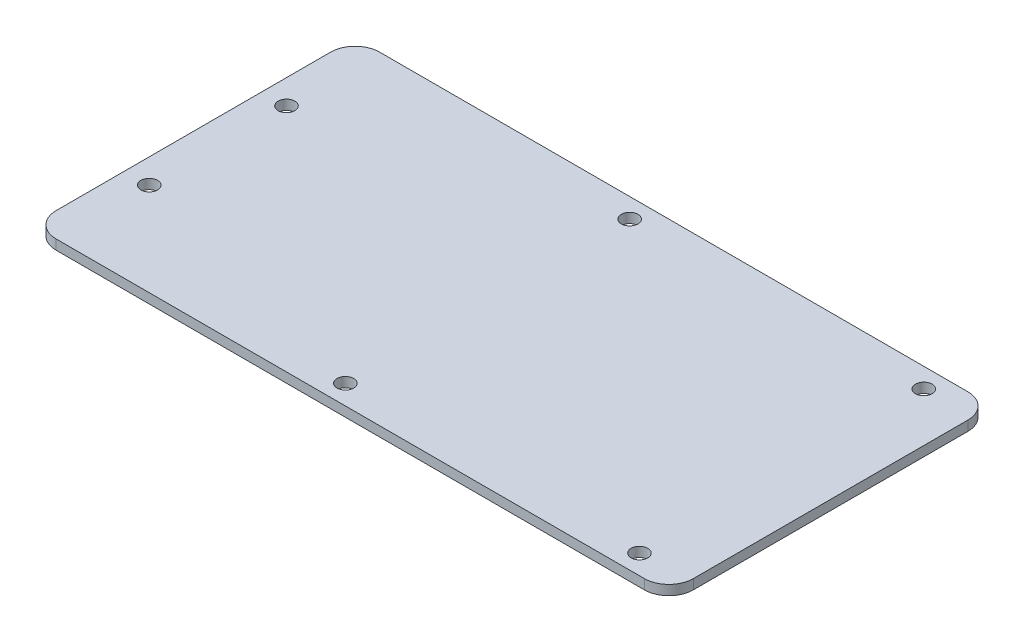
ISO-10303-21;
HEADER;
FILE_DESCRIPTION(('STEP AP214'),'2;1');
FILE_NAME('part.step','',(''),(''),'','','');
FILE_SCHEMA(('AUTOMOTIVE_DESIGN { 1 0 10303 214 1 1 1 1 }'));
ENDSEC;
DATA;
#1=APPLICATION_CONTEXT('core data for automotive mechanical design processes');
#2=APPLICATION_PROTOCOL_DEFINITION('international standard','automotive_design',2000,#1);
#3=PRODUCT_CONTEXT('',#1,'mechanical');
#4=PRODUCT('Part','Part','',(#3));
#5=PRODUCT_RELATED_PRODUCT_CATEGORY('part','',(#4));
#6=PRODUCT_DEFINITION_FORMATION('','',#4);
#7=PRODUCT_DEFINITION_CONTEXT('part definition',#1,'design');
#8=PRODUCT_DEFINITION('design','',#6,#7);
#9=PRODUCT_DEFINITION_SHAPE('','',#8);
#10=(LENGTH_UNIT() NAMED_UNIT(*) SI_UNIT(.MILLI.,.METRE.));
#11=(NAMED_UNIT(*) PLANE_ANGLE_UNIT() SI_UNIT($,.RADIAN.));
#12=(NAMED_UNIT(*) SI_UNIT($,.STERADIAN.) SOLID_ANGLE_UNIT());
#13=UNCERTAINTY_MEASURE_WITH_UNIT(LENGTH_MEASURE(1.E-05),#10,'distance_accuracy_value','');
#14=(GEOMETRIC_REPRESENTATION_CONTEXT(3) GLOBAL_UNCERTAINTY_ASSIGNED_CONTEXT((#13)) GLOBAL_UNIT_ASSIGNED_CONTEXT((#10,
#11,#12)) REPRESENTATION_CONTEXT('',''));
#15=CARTESIAN_POINT('',(0.,0.,0.));
#16=DIRECTION('',(0.,0.,1.));
#17=DIRECTION('',(1.,0.,0.));
#18=AXIS2_PLACEMENT_3D('',#15,#16,#17);
#19=CARTESIAN_POINT('',(0.,2.,0.));
#20=DIRECTION('',(1.,0.,0.));
#21=DIRECTION('',(0.,0.,-1.));
#22=AXIS2_PLACEMENT_3D('',#19,#20,#21);
#23=PLANE('',#22);
#24=DIRECTION('',(0.,0.,1.));
#25=VECTOR('',#24,1.);
#26=CARTESIAN_POINT('',(0.,0.,0.));
#27=LINE('',#26,#25);
#28=CARTESIAN_POINT('',(0.,0.,-61.));
#29=VERTEX_POINT('',#28);
#30=CARTESIAN_POINT('',(0.,0.,-5.));
#31=VERTEX_POINT('',#30);
#32=EDGE_CURVE('E156',#29,#31,#27,.T.);
#33=ORIENTED_EDGE('',*,*,#32,.T.);
#34=DIRECTION('',(0.,-1.,0.));
#35=VECTOR('',#34,1.);
#36=CARTESIAN_POINT('',(0.,2.,-5.));
#37=LINE('',#36,#35);
#38=CARTESIAN_POINT('',(0.,2.,-5.));
#39=VERTEX_POINT('',#38);
#40=EDGE_CURVE('E11',#31,#39,#37,.F.);
#41=ORIENTED_EDGE('',*,*,#40,.T.);
#42=DIRECTION('',(0.,0.,1.));
#43=VECTOR('',#42,1.);
#44=CARTESIAN_POINT('',(0.,2.,0.));
#45=LINE('',#44,#43);
#46=CARTESIAN_POINT('',(0.,2.,-61.));
#47=VERTEX_POINT('',#46);
#48=EDGE_CURVE('E124',#47,#39,#45,.T.);
#49=ORIENTED_EDGE('',*,*,#48,.F.);
#50=DIRECTION('',(0.,-1.,0.));
#51=VECTOR('',#50,1.);
#52=CARTESIAN_POINT('',(0.,2.,-61.));
#53=LINE('',#52,#51);
#54=EDGE_CURVE('E40',#47,#29,#53,.T.);
#55=ORIENTED_EDGE('',*,*,#54,.T.);
#56=EDGE_LOOP('',(#33,#41,#49,#55));
#57=FACE_BOUND('',#56,.T.);
#58=ADVANCED_FACE('F32',(#57),#23,.F.);
#59=CARTESIAN_POINT('',(0.,2.,0.));
#60=DIRECTION('',(0.,0.,-1.));
#61=DIRECTION('',(-1.,0.,0.));
#62=AXIS2_PLACEMENT_3D('',#59,#60,#61);
#63=PLANE('',#62);
#64=DIRECTION('',(1.,0.,0.));
#65=VECTOR('',#64,1.);
#66=CARTESIAN_POINT('',(0.,0.,0.));
#67=LINE('',#66,#65);
#68=CARTESIAN_POINT('',(5.,0.,0.));
#69=VERTEX_POINT('',#68);
#70=CARTESIAN_POINT('',(125.,0.,0.));
#71=VERTEX_POINT('',#70);
#72=EDGE_CURVE('E129',#69,#71,#67,.T.);
#73=ORIENTED_EDGE('',*,*,#72,.T.);
#74=DIRECTION('',(0.,-1.,0.));
#75=VECTOR('',#74,1.);
#76=CARTESIAN_POINT('',(125.,2.,0.));
#77=LINE('',#76,#75);
#78=CARTESIAN_POINT('',(125.,2.,0.));
#79=VERTEX_POINT('',#78);
#80=EDGE_CURVE('E47',#71,#79,#77,.F.);
#81=ORIENTED_EDGE('',*,*,#80,.T.);
#82=DIRECTION('',(1.,0.,0.));
#83=VECTOR('',#82,1.);
#84=CARTESIAN_POINT('',(0.,2.,0.));
#85=LINE('',#84,#83);
#86=CARTESIAN_POINT('',(5.,2.,0.));
#87=VERTEX_POINT('',#86);
#88=EDGE_CURVE('E127',#87,#79,#85,.T.);
#89=ORIENTED_EDGE('',*,*,#88,.F.);
#90=DIRECTION('',(0.,-1.,0.));
#91=VECTOR('',#90,1.);
#92=CARTESIAN_POINT('',(5.,2.,0.));
#93=LINE('',#92,#91);
#94=EDGE_CURVE('E148',#87,#69,#93,.T.);
#95=ORIENTED_EDGE('',*,*,#94,.T.);
#96=EDGE_LOOP('',(#73,#81,#89,#95));
#97=FACE_BOUND('',#96,.T.);
#98=ADVANCED_FACE('F227',(#97),#63,.F.);
#99=CARTESIAN_POINT('',(130.,2.,0.));
#100=DIRECTION('',(-1.,0.,0.));
#101=DIRECTION('',(0.,0.,1.));
#102=AXIS2_PLACEMENT_3D('',#99,#100,#101);
#103=PLANE('',#102);
#104=DIRECTION('',(0.,0.,-1.));
#105=VECTOR('',#104,1.);
#106=CARTESIAN_POINT('',(130.,0.,0.));
#107=LINE('',#106,#105);
#108=CARTESIAN_POINT('',(130.,0.,-5.));
#109=VERTEX_POINT('',#108);
#110=CARTESIAN_POINT('',(130.,0.,-61.));
#111=VERTEX_POINT('',#110);
#112=EDGE_CURVE('E125',#109,#111,#107,.T.);
#113=ORIENTED_EDGE('',*,*,#112,.T.);
#114=DIRECTION('',(0.,-1.,0.));
#115=VECTOR('',#114,1.);
#116=CARTESIAN_POINT('',(130.,2.,-61.));
#117=LINE('',#116,#115);
#118=CARTESIAN_POINT('',(130.,2.,-61.));
#119=VERTEX_POINT('',#118);
#120=EDGE_CURVE('E103',#111,#119,#117,.F.);
#121=ORIENTED_EDGE('',*,*,#120,.T.);
#122=DIRECTION('',(0.,0.,-1.));
#123=VECTOR('',#122,1.);
#124=CARTESIAN_POINT('',(130.,2.,0.));
#125=LINE('',#124,#123);
#126=CARTESIAN_POINT('',(130.,2.,-5.));
#127=VERTEX_POINT('',#126);
#128=EDGE_CURVE('E168',#127,#119,#125,.T.);
#129=ORIENTED_EDGE('',*,*,#128,.F.);
#130=DIRECTION('',(0.,-1.,0.));
#131=VECTOR('',#130,1.);
#132=CARTESIAN_POINT('',(130.,2.,-5.));
#133=LINE('',#132,#131);
#134=EDGE_CURVE('E108',#127,#109,#133,.T.);
#135=ORIENTED_EDGE('',*,*,#134,.T.);
#136=EDGE_LOOP('',(#113,#121,#129,#135));
#137=FACE_BOUND('',#136,.T.);
#138=ADVANCED_FACE('F224',(#137),#103,.F.);
#139=CARTESIAN_POINT('',(0.,2.,-66.));
#140=DIRECTION('',(0.,0.,1.));
#141=DIRECTION('',(1.,0.,0.));
#142=AXIS2_PLACEMENT_3D('',#139,#140,#141);
#143=PLANE('',#142);
#144=DIRECTION('',(-1.,0.,0.));
#145=VECTOR('',#144,1.);
#146=CARTESIAN_POINT('',(0.,2.,-66.));
#147=LINE('',#146,#145);
#148=CARTESIAN_POINT('',(125.,2.,-66.));
#149=VERTEX_POINT('',#148);
#150=CARTESIAN_POINT('',(5.,2.,-66.));
#151=VERTEX_POINT('',#150);
#152=EDGE_CURVE('E118',#149,#151,#147,.T.);
#153=ORIENTED_EDGE('',*,*,#152,.F.);
#154=DIRECTION('',(0.,-1.,0.));
#155=VECTOR('',#154,1.);
#156=CARTESIAN_POINT('',(125.,2.,-66.));
#157=LINE('',#156,#155);
#158=CARTESIAN_POINT('',(125.,0.,-66.));
#159=VERTEX_POINT('',#158);
#160=EDGE_CURVE('E102',#149,#159,#157,.T.);
#161=ORIENTED_EDGE('',*,*,#160,.T.);
#162=DIRECTION('',(-1.,0.,0.));
#163=VECTOR('',#162,1.);
#164=CARTESIAN_POINT('',(0.,0.,-66.));
#165=LINE('',#164,#163);
#166=CARTESIAN_POINT('',(5.,0.,-66.));
#167=VERTEX_POINT('',#166);
#168=EDGE_CURVE('E115',#159,#167,#165,.T.);
#169=ORIENTED_EDGE('',*,*,#168,.T.);
#170=DIRECTION('',(0.,-1.,0.));
#171=VECTOR('',#170,1.);
#172=CARTESIAN_POINT('',(5.,2.,-66.));
#173=LINE('',#172,#171);
#174=EDGE_CURVE('E120',#167,#151,#173,.F.);
#175=ORIENTED_EDGE('',*,*,#174,.T.);
#176=EDGE_LOOP('',(#153,#161,#169,#175));
#177=FACE_BOUND('',#176,.T.);
#178=ADVANCED_FACE('F114',(#177),#143,.F.);
#179=CARTESIAN_POINT('',(0.,2.,0.));
#180=DIRECTION('',(0.,-1.,0.));
#181=DIRECTION('',(0.,0.,-1.));
#182=AXIS2_PLACEMENT_3D('',#179,#180,#181);
#183=PLANE('',#182);
#184=CARTESIAN_POINT('',(5.00000000000001,2.,-19.));
#185=DIRECTION('',(0.,1.,0.));
#186=DIRECTION('',(0.,0.,1.));
#187=AXIS2_PLACEMENT_3D('',#184,#185,#186);
#188=CIRCLE('',#187,1.7);
#189=CARTESIAN_POINT('',(5.00000000000001,2.,-17.3));
#190=VERTEX_POINT('',#189);
#191=EDGE_CURVE('E201',#190,#190,#188,.T.);
#192=ORIENTED_EDGE('',*,*,#191,.F.);
#193=EDGE_LOOP('',(#192));
#194=FACE_BOUND('',#193,.T.);
#195=CARTESIAN_POINT('',(60.,2.,-4.));
#196=DIRECTION('',(0.,1.,0.));
#197=DIRECTION('',(0.,0.,1.));
#198=AXIS2_PLACEMENT_3D('',#195,#196,#197);
#199=CIRCLE('',#198,1.7);
#200=CARTESIAN_POINT('',(60.,2.,-2.3));
#201=VERTEX_POINT('',#200);
#202=EDGE_CURVE('E195',#201,#201,#199,.T.);
#203=ORIENTED_EDGE('',*,*,#202,.F.);
#204=EDGE_LOOP('',(#203));
#205=FACE_BOUND('',#204,.T.);
#206=CARTESIAN_POINT('',(120.,2.,-4.));
#207=DIRECTION('',(0.,1.,0.));
#208=DIRECTION('',(0.,0.,1.));
#209=AXIS2_PLACEMENT_3D('',#206,#207,#208);
#210=CIRCLE('',#209,1.69999999999999);
#211=CARTESIAN_POINT('',(120.,2.,-2.30000000000001));
#212=VERTEX_POINT('',#211);
#213=EDGE_CURVE('E189',#212,#212,#210,.T.);
#214=ORIENTED_EDGE('',*,*,#213,.F.);
#215=EDGE_LOOP('',(#214));
#216=FACE_BOUND('',#215,.T.);
#217=CARTESIAN_POINT('',(120.,2.,-62.));
#218=DIRECTION('',(0.,1.,0.));
#219=DIRECTION('',(0.,0.,1.));
#220=AXIS2_PLACEMENT_3D('',#217,#218,#219);
#221=CIRCLE('',#220,1.69999999999999);
#222=CARTESIAN_POINT('',(120.,2.,-60.3));
#223=VERTEX_POINT('',#222);
#224=EDGE_CURVE('E183',#223,#223,#221,.T.);
#225=ORIENTED_EDGE('',*,*,#224,.F.);
#226=EDGE_LOOP('',(#225));
#227=FACE_BOUND('',#226,.T.);
#228=CARTESIAN_POINT('',(60.,2.,-62.));
#229=DIRECTION('',(0.,1.,0.));
#230=DIRECTION('',(0.,0.,1.));
#231=AXIS2_PLACEMENT_3D('',#228,#229,#230);
#232=CIRCLE('',#231,1.7);
#233=CARTESIAN_POINT('',(60.,2.,-60.3));
#234=VERTEX_POINT('',#233);
#235=EDGE_CURVE('E177',#234,#234,#232,.T.);
#236=ORIENTED_EDGE('',*,*,#235,.F.);
#237=EDGE_LOOP('',(#236));
#238=FACE_BOUND('',#237,.T.);
#239=CARTESIAN_POINT('',(5.00000000000001,2.,-47.));
#240=DIRECTION('',(0.,1.,0.));
#241=DIRECTION('',(0.,0.,1.));
#242=AXIS2_PLACEMENT_3D('',#239,#240,#241);
#243=CIRCLE('',#242,1.7);
#244=CARTESIAN_POINT('',(5.00000000000001,2.,-45.3));
#245=VERTEX_POINT('',#244);
#246=EDGE_CURVE('E164',#245,#245,#243,.T.);
#247=ORIENTED_EDGE('',*,*,#246,.F.);
#248=EDGE_LOOP('',(#247));
#249=FACE_BOUND('',#248,.T.);
#250=ORIENTED_EDGE('',*,*,#128,.T.);
#251=CARTESIAN_POINT('',(125.,2.,-61.));
#252=DIRECTION('',(0.,-1.,0.));
#253=DIRECTION('',(0.,0.,-1.));
#254=AXIS2_PLACEMENT_3D('',#251,#252,#253);
#255=CIRCLE('',#254,5.);
#256=EDGE_CURVE('E146',#119,#149,#255,.F.);
#257=ORIENTED_EDGE('',*,*,#256,.T.);
#258=ORIENTED_EDGE('',*,*,#152,.T.);
#259=CARTESIAN_POINT('',(5.,2.,-61.));
#260=DIRECTION('',(0.,-1.,0.));
#261=DIRECTION('',(0.,0.,-1.));
#262=AXIS2_PLACEMENT_3D('',#259,#260,#261);
#263=CIRCLE('',#262,5.);
#264=EDGE_CURVE('E141',#151,#47,#263,.F.);
#265=ORIENTED_EDGE('',*,*,#264,.T.);
#266=ORIENTED_EDGE('',*,*,#48,.T.);
#267=CARTESIAN_POINT('',(5.,2.,-5.));
#268=DIRECTION('',(0.,-1.,0.));
#269=DIRECTION('',(0.,0.,-1.));
#270=AXIS2_PLACEMENT_3D('',#267,#268,#269);
#271=CIRCLE('',#270,5.);
#272=EDGE_CURVE('E54',#39,#87,#271,.F.);
#273=ORIENTED_EDGE('',*,*,#272,.T.);
#274=ORIENTED_EDGE('',*,*,#88,.T.);
#275=CARTESIAN_POINT('',(125.,2.,-5.));
#276=DIRECTION('',(0.,-1.,0.));
#277=DIRECTION('',(0.,0.,-1.));
#278=AXIS2_PLACEMENT_3D('',#275,#276,#277);
#279=CIRCLE('',#278,5.);
#280=EDGE_CURVE('E144',#79,#127,#279,.F.);
#281=ORIENTED_EDGE('',*,*,#280,.T.);
#282=EDGE_LOOP('',(#250,#257,#258,#265,#266,#273,#274,#281));
#283=FACE_BOUND('',#282,.T.);
#284=ADVANCED_FACE('F207',(#194,#205,#216,#227,#238,#249,#283),#183,.F.);
#285=CARTESIAN_POINT('',(0.,0.,0.));
#286=DIRECTION('',(0.,-1.,0.));
#287=DIRECTION('',(0.,0.,-1.));
#288=AXIS2_PLACEMENT_3D('',#285,#286,#287);
#289=PLANE('',#288);
#290=CARTESIAN_POINT('',(5.00000000000001,0.,-19.));
#291=DIRECTION('',(0.,1.,0.));
#292=DIRECTION('',(0.,0.,1.));
#293=AXIS2_PLACEMENT_3D('',#290,#291,#292);
#294=CIRCLE('',#293,1.7);
#295=CARTESIAN_POINT('',(5.00000000000001,0.,-17.3));
#296=VERTEX_POINT('',#295);
#297=EDGE_CURVE('E198',#296,#296,#294,.T.);
#298=ORIENTED_EDGE('',*,*,#297,.T.);
#299=EDGE_LOOP('',(#298));
#300=FACE_BOUND('',#299,.T.);
#301=CARTESIAN_POINT('',(60.,0.,-4.));
#302=DIRECTION('',(0.,1.,0.));
#303=DIRECTION('',(0.,0.,1.));
#304=AXIS2_PLACEMENT_3D('',#301,#302,#303);
#305=CIRCLE('',#304,1.7);
#306=CARTESIAN_POINT('',(60.,0.,-2.3));
#307=VERTEX_POINT('',#306);
#308=EDGE_CURVE('E192',#307,#307,#305,.T.);
#309=ORIENTED_EDGE('',*,*,#308,.T.);
#310=EDGE_LOOP('',(#309));
#311=FACE_BOUND('',#310,.T.);
#312=CARTESIAN_POINT('',(120.,0.,-4.));
#313=DIRECTION('',(0.,1.,0.));
#314=DIRECTION('',(0.,0.,1.));
#315=AXIS2_PLACEMENT_3D('',#312,#313,#314);
#316=CIRCLE('',#315,1.69999999999999);
#317=CARTESIAN_POINT('',(120.,0.,-2.30000000000001));
#318=VERTEX_POINT('',#317);
#319=EDGE_CURVE('E186',#318,#318,#316,.T.);
#320=ORIENTED_EDGE('',*,*,#319,.T.);
#321=EDGE_LOOP('',(#320));
#322=FACE_BOUND('',#321,.T.);
#323=CARTESIAN_POINT('',(120.,0.,-62.));
#324=DIRECTION('',(0.,1.,0.));
#325=DIRECTION('',(0.,0.,1.));
#326=AXIS2_PLACEMENT_3D('',#323,#324,#325);
#327=CIRCLE('',#326,1.69999999999999);
#328=CARTESIAN_POINT('',(120.,0.,-60.3));
#329=VERTEX_POINT('',#328);
#330=EDGE_CURVE('E180',#329,#329,#327,.T.);
#331=ORIENTED_EDGE('',*,*,#330,.T.);
#332=EDGE_LOOP('',(#331));
#333=FACE_BOUND('',#332,.T.);
#334=CARTESIAN_POINT('',(60.,0.,-62.));
#335=DIRECTION('',(0.,1.,0.));
#336=DIRECTION('',(0.,0.,1.));
#337=AXIS2_PLACEMENT_3D('',#334,#335,#336);
#338=CIRCLE('',#337,1.7);
#339=CARTESIAN_POINT('',(60.,0.,-60.3));
#340=VERTEX_POINT('',#339);
#341=EDGE_CURVE('E174',#340,#340,#338,.T.);
#342=ORIENTED_EDGE('',*,*,#341,.T.);
#343=EDGE_LOOP('',(#342));
#344=FACE_BOUND('',#343,.T.);
#345=CARTESIAN_POINT('',(5.00000000000001,0.,-47.));
#346=DIRECTION('',(0.,1.,0.));
#347=DIRECTION('',(0.,0.,1.));
#348=AXIS2_PLACEMENT_3D('',#345,#346,#347);
#349=CIRCLE('',#348,1.7);
#350=CARTESIAN_POINT('',(5.00000000000001,0.,-45.3));
#351=VERTEX_POINT('',#350);
#352=EDGE_CURVE('E161',#351,#351,#349,.T.);
#353=ORIENTED_EDGE('',*,*,#352,.T.);
#354=EDGE_LOOP('',(#353));
#355=FACE_BOUND('',#354,.T.);
#356=ORIENTED_EDGE('',*,*,#168,.F.);
#357=CARTESIAN_POINT('',(125.,0.,-61.));
#358=DIRECTION('',(0.,-1.,0.));
#359=DIRECTION('',(0.,0.,-1.));
#360=AXIS2_PLACEMENT_3D('',#357,#358,#359);
#361=CIRCLE('',#360,5.);
#362=EDGE_CURVE('E98',#159,#111,#361,.T.);
#363=ORIENTED_EDGE('',*,*,#362,.T.);
#364=ORIENTED_EDGE('',*,*,#112,.F.);
#365=CARTESIAN_POINT('',(125.,0.,-5.));
#366=DIRECTION('',(0.,-1.,0.));
#367=DIRECTION('',(0.,0.,-1.));
#368=AXIS2_PLACEMENT_3D('',#365,#366,#367);
#369=CIRCLE('',#368,5.);
#370=EDGE_CURVE('E109',#109,#71,#369,.T.);
#371=ORIENTED_EDGE('',*,*,#370,.T.);
#372=ORIENTED_EDGE('',*,*,#72,.F.);
#373=CARTESIAN_POINT('',(5.,0.,-5.));
#374=DIRECTION('',(0.,-1.,0.));
#375=DIRECTION('',(0.,0.,-1.));
#376=AXIS2_PLACEMENT_3D('',#373,#374,#375);
#377=CIRCLE('',#376,5.);
#378=EDGE_CURVE('E135',#69,#31,#377,.T.);
#379=ORIENTED_EDGE('',*,*,#378,.T.);
#380=ORIENTED_EDGE('',*,*,#32,.F.);
#381=CARTESIAN_POINT('',(5.,0.,-61.));
#382=DIRECTION('',(0.,-1.,0.));
#383=DIRECTION('',(0.,0.,-1.));
#384=AXIS2_PLACEMENT_3D('',#381,#382,#383);
#385=CIRCLE('',#384,5.);
#386=EDGE_CURVE('E119',#29,#167,#385,.T.);
#387=ORIENTED_EDGE('',*,*,#386,.T.);
#388=EDGE_LOOP('',(#356,#363,#364,#371,#372,#379,#380,#387));
#389=FACE_BOUND('',#388,.T.);
#390=ADVANCED_FACE('F122',(#300,#311,#322,#333,#344,#355,#389),#289,.T.);
#391=CARTESIAN_POINT('',(125.,2.,-61.));
#392=DIRECTION('',(0.,-1.,0.));
#393=DIRECTION('',(0.,0.,-1.));
#394=AXIS2_PLACEMENT_3D('',#391,#392,#393);
#395=CYLINDRICAL_SURFACE('',#394,5.);
#396=ORIENTED_EDGE('',*,*,#256,.F.);
#397=ORIENTED_EDGE('',*,*,#120,.F.);
#398=ORIENTED_EDGE('',*,*,#362,.F.);
#399=ORIENTED_EDGE('',*,*,#160,.F.);
#400=EDGE_LOOP('',(#396,#397,#398,#399));
#401=FACE_BOUND('',#400,.T.);
#402=ADVANCED_FACE('F101',(#401),#395,.T.);
#403=CARTESIAN_POINT('',(125.,2.,-5.));
#404=DIRECTION('',(0.,-1.,0.));
#405=DIRECTION('',(0.,0.,-1.));
#406=AXIS2_PLACEMENT_3D('',#403,#404,#405);
#407=CYLINDRICAL_SURFACE('',#406,5.);
#408=ORIENTED_EDGE('',*,*,#280,.F.);
#409=ORIENTED_EDGE('',*,*,#80,.F.);
#410=ORIENTED_EDGE('',*,*,#370,.F.);
#411=ORIENTED_EDGE('',*,*,#134,.F.);
#412=EDGE_LOOP('',(#408,#409,#410,#411));
#413=FACE_BOUND('',#412,.T.);
#414=ADVANCED_FACE('F226',(#413),#407,.T.);
#415=CARTESIAN_POINT('',(5.,2.,-5.));
#416=DIRECTION('',(0.,-1.,0.));
#417=DIRECTION('',(0.,0.,-1.));
#418=AXIS2_PLACEMENT_3D('',#415,#416,#417);
#419=CYLINDRICAL_SURFACE('',#418,5.);
#420=ORIENTED_EDGE('',*,*,#272,.F.);
#421=ORIENTED_EDGE('',*,*,#40,.F.);
#422=ORIENTED_EDGE('',*,*,#378,.F.);
#423=ORIENTED_EDGE('',*,*,#94,.F.);
#424=EDGE_LOOP('',(#420,#421,#422,#423));
#425=FACE_BOUND('',#424,.T.);
#426=ADVANCED_FACE('F230',(#425),#419,.T.);
#427=CARTESIAN_POINT('',(5.,2.,-61.));
#428=DIRECTION('',(0.,-1.,0.));
#429=DIRECTION('',(0.,0.,-1.));
#430=AXIS2_PLACEMENT_3D('',#427,#428,#429);
#431=CYLINDRICAL_SURFACE('',#430,5.);
#432=ORIENTED_EDGE('',*,*,#264,.F.);
#433=ORIENTED_EDGE('',*,*,#174,.F.);
#434=ORIENTED_EDGE('',*,*,#386,.F.);
#435=ORIENTED_EDGE('',*,*,#54,.F.);
#436=EDGE_LOOP('',(#432,#433,#434,#435));
#437=FACE_BOUND('',#436,.T.);
#438=ADVANCED_FACE('F34',(#437),#431,.T.);
#439=CARTESIAN_POINT('',(5.00000000000001,2.,-47.));
#440=DIRECTION('',(0.,1.,0.));
#441=DIRECTION('',(0.,0.,1.));
#442=AXIS2_PLACEMENT_3D('',#439,#440,#441);
#443=CYLINDRICAL_SURFACE('',#442,1.7);
#444=ORIENTED_EDGE('',*,*,#352,.F.);
#445=EDGE_LOOP('',(#444));
#446=FACE_BOUND('',#445,.T.);
#447=ORIENTED_EDGE('',*,*,#246,.T.);
#448=EDGE_LOOP('',(#447));
#449=FACE_BOUND('',#448,.T.);
#450=ADVANCED_FACE('F232',(#446,#449),#443,.F.);
#451=CARTESIAN_POINT('',(60.,2.,-62.));
#452=DIRECTION('',(0.,1.,0.));
#453=DIRECTION('',(0.,0.,1.));
#454=AXIS2_PLACEMENT_3D('',#451,#452,#453);
#455=CYLINDRICAL_SURFACE('',#454,1.7);
#456=ORIENTED_EDGE('',*,*,#341,.F.);
#457=EDGE_LOOP('',(#456));
#458=FACE_BOUND('',#457,.T.);
#459=ORIENTED_EDGE('',*,*,#235,.T.);
#460=EDGE_LOOP('',(#459));
#461=FACE_BOUND('',#460,.T.);
#462=ADVANCED_FACE('F237',(#458,#461),#455,.F.);
#463=CARTESIAN_POINT('',(120.,2.,-62.));
#464=DIRECTION('',(0.,1.,0.));
#465=DIRECTION('',(0.,0.,1.));
#466=AXIS2_PLACEMENT_3D('',#463,#464,#465);
#467=CYLINDRICAL_SURFACE('',#466,1.69999999999999);
#468=ORIENTED_EDGE('',*,*,#330,.F.);
#469=EDGE_LOOP('',(#468));
#470=FACE_BOUND('',#469,.T.);
#471=ORIENTED_EDGE('',*,*,#224,.T.);
#472=EDGE_LOOP('',(#471));
#473=FACE_BOUND('',#472,.T.);
#474=ADVANCED_FACE('F296',(#470,#473),#467,.F.);
#475=CARTESIAN_POINT('',(120.,2.,-4.));
#476=DIRECTION('',(0.,1.,0.));
#477=DIRECTION('',(0.,0.,1.));
#478=AXIS2_PLACEMENT_3D('',#475,#476,#477);
#479=CYLINDRICAL_SURFACE('',#478,1.69999999999999);
#480=ORIENTED_EDGE('',*,*,#319,.F.);
#481=EDGE_LOOP('',(#480));
#482=FACE_BOUND('',#481,.T.);
#483=ORIENTED_EDGE('',*,*,#213,.T.);
#484=EDGE_LOOP('',(#483));
#485=FACE_BOUND('',#484,.T.);
#486=ADVANCED_FACE('F306',(#482,#485),#479,.F.);
#487=CARTESIAN_POINT('',(60.,2.,-4.));
#488=DIRECTION('',(0.,1.,0.));
#489=DIRECTION('',(0.,0.,1.));
#490=AXIS2_PLACEMENT_3D('',#487,#488,#489);
#491=CYLINDRICAL_SURFACE('',#490,1.7);
#492=ORIENTED_EDGE('',*,*,#308,.F.);
#493=EDGE_LOOP('',(#492));
#494=FACE_BOUND('',#493,.T.);
#495=ORIENTED_EDGE('',*,*,#202,.T.);
#496=EDGE_LOOP('',(#495));
#497=FACE_BOUND('',#496,.T.);
#498=ADVANCED_FACE('F316',(#494,#497),#491,.F.);
#499=CARTESIAN_POINT('',(5.00000000000001,2.,-19.));
#500=DIRECTION('',(0.,1.,0.));
#501=DIRECTION('',(0.,0.,1.));
#502=AXIS2_PLACEMENT_3D('',#499,#500,#501);
#503=CYLINDRICAL_SURFACE('',#502,1.7);
#504=ORIENTED_EDGE('',*,*,#297,.F.);
#505=EDGE_LOOP('',(#504));
#506=FACE_BOUND('',#505,.T.);
#507=ORIENTED_EDGE('',*,*,#191,.T.);
#508=EDGE_LOOP('',(#507));
#509=FACE_BOUND('',#508,.T.);
#510=ADVANCED_FACE('F205',(#506,#509),#503,.F.);
#511=CLOSED_SHELL('',(#58,#98,#138,#178,#284,#390,#402,#414,#426,#438,#450,#462,#474,#486,#498,#510));
#512=MANIFOLD_SOLID_BREP('B2',#511);
#513=ADVANCED_BREP_SHAPE_REPRESENTATION('',(#18,#512),#14);
#514=SHAPE_DEFINITION_REPRESENTATION(#9,#513);
ENDSEC;
END-ISO-10303-21;
